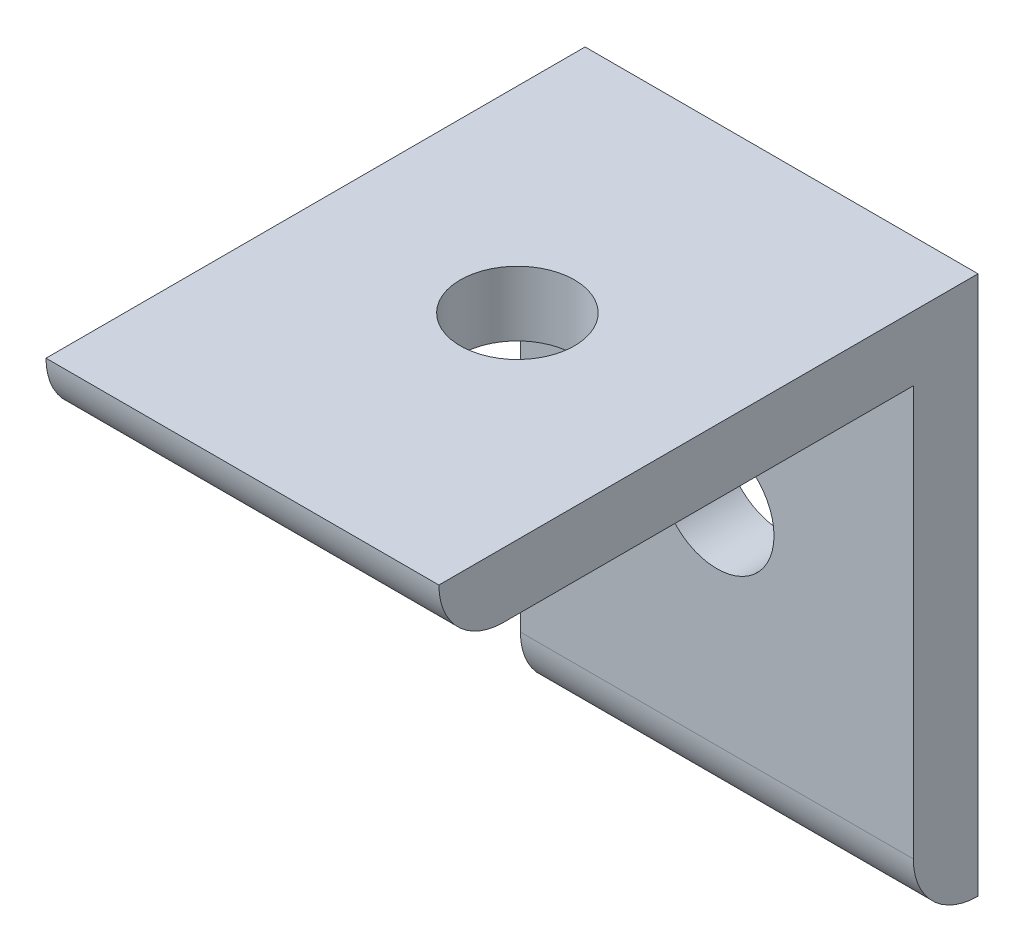
ISO-10303-21;
HEADER;
FILE_DESCRIPTION(('STEP AP214'),'2;1');
FILE_NAME('part.step','',(''),(''),'','','');
FILE_SCHEMA(('AUTOMOTIVE_DESIGN { 1 0 10303 214 1 1 1 1 }'));
ENDSEC;
DATA;
#1=APPLICATION_CONTEXT('core data for automotive mechanical design processes');
#2=APPLICATION_PROTOCOL_DEFINITION('international standard','automotive_design',2000,#1);
#3=PRODUCT_CONTEXT('',#1,'mechanical');
#4=PRODUCT('Part','Part','',(#3));
#5=PRODUCT_RELATED_PRODUCT_CATEGORY('part','',(#4));
#6=PRODUCT_DEFINITION_FORMATION('','',#4);
#7=PRODUCT_DEFINITION_CONTEXT('part definition',#1,'design');
#8=PRODUCT_DEFINITION('design','',#6,#7);
#9=PRODUCT_DEFINITION_SHAPE('','',#8);
#10=(LENGTH_UNIT() NAMED_UNIT(*) SI_UNIT(.MILLI.,.METRE.));
#11=(NAMED_UNIT(*) PLANE_ANGLE_UNIT() SI_UNIT($,.RADIAN.));
#12=(NAMED_UNIT(*) SI_UNIT($,.STERADIAN.) SOLID_ANGLE_UNIT());
#13=UNCERTAINTY_MEASURE_WITH_UNIT(LENGTH_MEASURE(1.E-05),#10,'distance_accuracy_value','');
#14=(GEOMETRIC_REPRESENTATION_CONTEXT(3) GLOBAL_UNCERTAINTY_ASSIGNED_CONTEXT((#13)) GLOBAL_UNIT_ASSIGNED_CONTEXT((#10,
#11,#12)) REPRESENTATION_CONTEXT('',''));
#15=CARTESIAN_POINT('',(0.,0.,0.));
#16=DIRECTION('',(0.,0.,1.));
#17=DIRECTION('',(1.,0.,0.));
#18=AXIS2_PLACEMENT_3D('',#15,#16,#17);
#19=CARTESIAN_POINT('',(-88.5808864008386,-309.665681156461,3.));
#20=DIRECTION('',(1.,0.,0.));
#21=DIRECTION('',(0.,0.,-1.));
#22=AXIS2_PLACEMENT_3D('',#19,#20,#21);
#23=PLANE('',#22);
#24=DIRECTION('',(0.,0.,-1.));
#25=VECTOR('',#24,1.);
#26=CARTESIAN_POINT('',(-88.5808864008386,-312.665681156461,25.));
#27=LINE('',#26,#25);
#28=CARTESIAN_POINT('',(-88.5808864008386,-312.665681156461,22.));
#29=VERTEX_POINT('',#28);
#30=CARTESIAN_POINT('',(-88.5808864008386,-312.665681156461,3.));
#31=VERTEX_POINT('',#30);
#32=EDGE_CURVE('E112',#29,#31,#27,.T.);
#33=ORIENTED_EDGE('',*,*,#32,.F.);
#34=CARTESIAN_POINT('',(-88.5808864008386,-309.665681156461,22.));
#35=DIRECTION('',(1.,0.,0.));
#36=DIRECTION('',(0.,0.,-1.));
#37=AXIS2_PLACEMENT_3D('',#34,#35,#36);
#38=CIRCLE('',#37,3.);
#39=CARTESIAN_POINT('',(-88.5808864008386,-309.665681156461,25.));
#40=VERTEX_POINT('',#39);
#41=EDGE_CURVE('E40',#29,#40,#38,.F.);
#42=ORIENTED_EDGE('',*,*,#41,.T.);
#43=DIRECTION('',(0.,0.,-1.));
#44=VECTOR('',#43,1.);
#45=CARTESIAN_POINT('',(-88.5808864008386,-309.665681156461,3.));
#46=LINE('',#45,#44);
#47=CARTESIAN_POINT('',(-88.5808864008386,-309.665681156461,0.));
#48=VERTEX_POINT('',#47);
#49=EDGE_CURVE('E104',#40,#48,#46,.T.);
#50=ORIENTED_EDGE('',*,*,#49,.T.);
#51=DIRECTION('',(0.,-1.,0.));
#52=VECTOR('',#51,1.);
#53=CARTESIAN_POINT('',(-88.5808864008386,-309.665681156461,0.));
#54=LINE('',#53,#52);
#55=CARTESIAN_POINT('',(-88.5808864008386,-334.665681156461,0.));
#56=VERTEX_POINT('',#55);
#57=EDGE_CURVE('E137',#48,#56,#54,.T.);
#58=ORIENTED_EDGE('',*,*,#57,.T.);
#59=CARTESIAN_POINT('',(-88.5808864008386,-331.665681156461,0.));
#60=DIRECTION('',(1.,0.,0.));
#61=DIRECTION('',(0.,0.,-1.));
#62=AXIS2_PLACEMENT_3D('',#59,#60,#61);
#63=CIRCLE('',#62,3.);
#64=CARTESIAN_POINT('',(-88.5808864008386,-331.665681156461,3.));
#65=VERTEX_POINT('',#64);
#66=EDGE_CURVE('E47',#56,#65,#63,.F.);
#67=ORIENTED_EDGE('',*,*,#66,.T.);
#68=DIRECTION('',(0.,-1.,0.));
#69=VECTOR('',#68,1.);
#70=CARTESIAN_POINT('',(-88.5808864008386,-309.665681156461,3.));
#71=LINE('',#70,#69);
#72=EDGE_CURVE('E127',#31,#65,#71,.T.);
#73=ORIENTED_EDGE('',*,*,#72,.F.);
#74=EDGE_LOOP('',(#33,#42,#50,#58,#67,#73));
#75=FACE_BOUND('',#74,.T.);
#76=ADVANCED_FACE('F32',(#75),#23,.F.);
#77=CARTESIAN_POINT('',(-70.3608864008386,-309.665681156461,3.));
#78=DIRECTION('',(-1.,0.,0.));
#79=DIRECTION('',(0.,0.,1.));
#80=AXIS2_PLACEMENT_3D('',#77,#78,#79);
#81=PLANE('',#80);
#82=DIRECTION('',(0.,0.,-1.));
#83=VECTOR('',#82,1.);
#84=CARTESIAN_POINT('',(-70.3608864008386,-309.665681156461,3.));
#85=LINE('',#84,#83);
#86=CARTESIAN_POINT('',(-70.3608864008386,-309.665681156461,25.));
#87=VERTEX_POINT('',#86);
#88=CARTESIAN_POINT('',(-70.3608864008386,-309.665681156461,0.));
#89=VERTEX_POINT('',#88);
#90=EDGE_CURVE('E98',#87,#89,#85,.T.);
#91=ORIENTED_EDGE('',*,*,#90,.F.);
#92=CARTESIAN_POINT('',(-70.3608864008386,-309.665681156461,22.));
#93=DIRECTION('',(-1.,0.,0.));
#94=DIRECTION('',(0.,0.,1.));
#95=AXIS2_PLACEMENT_3D('',#92,#93,#94);
#96=CIRCLE('',#95,3.);
#97=CARTESIAN_POINT('',(-70.3608864008386,-312.665681156461,22.));
#98=VERTEX_POINT('',#97);
#99=EDGE_CURVE('E87',#87,#98,#96,.F.);
#100=ORIENTED_EDGE('',*,*,#99,.T.);
#101=DIRECTION('',(0.,0.,-1.));
#102=VECTOR('',#101,1.);
#103=CARTESIAN_POINT('',(-70.3608864008386,-312.665681156461,25.));
#104=LINE('',#103,#102);
#105=CARTESIAN_POINT('',(-70.3608864008386,-312.665681156461,3.));
#106=VERTEX_POINT('',#105);
#107=EDGE_CURVE('E109',#98,#106,#104,.T.);
#108=ORIENTED_EDGE('',*,*,#107,.T.);
#109=DIRECTION('',(0.,1.,0.));
#110=VECTOR('',#109,1.);
#111=CARTESIAN_POINT('',(-70.3608864008386,-309.665681156461,3.));
#112=LINE('',#111,#110);
#113=CARTESIAN_POINT('',(-70.3608864008386,-331.665681156461,3.));
#114=VERTEX_POINT('',#113);
#115=EDGE_CURVE('E133',#114,#106,#112,.T.);
#116=ORIENTED_EDGE('',*,*,#115,.F.);
#117=CARTESIAN_POINT('',(-70.3608864008386,-331.665681156461,0.));
#118=DIRECTION('',(-1.,0.,0.));
#119=DIRECTION('',(0.,0.,1.));
#120=AXIS2_PLACEMENT_3D('',#117,#118,#119);
#121=CIRCLE('',#120,3.);
#122=CARTESIAN_POINT('',(-70.3608864008386,-334.665681156461,0.));
#123=VERTEX_POINT('',#122);
#124=EDGE_CURVE('E95',#114,#123,#121,.F.);
#125=ORIENTED_EDGE('',*,*,#124,.T.);
#126=DIRECTION('',(0.,1.,0.));
#127=VECTOR('',#126,1.);
#128=CARTESIAN_POINT('',(-70.3608864008386,-309.665681156461,0.));
#129=LINE('',#128,#127);
#130=EDGE_CURVE('E101',#123,#89,#129,.T.);
#131=ORIENTED_EDGE('',*,*,#130,.T.);
#132=EDGE_LOOP('',(#91,#100,#108,#116,#125,#131));
#133=FACE_BOUND('',#132,.T.);
#134=ADVANCED_FACE('F99',(#133),#81,.F.);
#135=CARTESIAN_POINT('',(-88.5808864008386,-309.665681156461,3.));
#136=DIRECTION('',(0.,-1.,0.));
#137=DIRECTION('',(0.,0.,-1.));
#138=AXIS2_PLACEMENT_3D('',#135,#136,#137);
#139=PLANE('',#138);
#140=CARTESIAN_POINT('',(-79.4708864008386,-309.665681156461,12.25));
#141=DIRECTION('',(0.,-1.,0.));
#142=DIRECTION('',(0.,0.,-1.));
#143=AXIS2_PLACEMENT_3D('',#140,#141,#142);
#144=CIRCLE('',#143,2.65);
#145=CARTESIAN_POINT('',(-79.4708864008386,-309.665681156461,9.6));
#146=VERTEX_POINT('',#145);
#147=EDGE_CURVE('E199',#146,#146,#144,.T.);
#148=ORIENTED_EDGE('',*,*,#147,.T.);
#149=EDGE_LOOP('',(#148));
#150=FACE_BOUND('',#149,.T.);
#151=DIRECTION('',(-1.,0.,0.));
#152=VECTOR('',#151,1.);
#153=CARTESIAN_POINT('',(-88.5808864008386,-309.665681156461,0.));
#154=LINE('',#153,#152);
#155=EDGE_CURVE('E143',#89,#48,#154,.T.);
#156=ORIENTED_EDGE('',*,*,#155,.T.);
#157=ORIENTED_EDGE('',*,*,#49,.F.);
#158=DIRECTION('',(-1.,0.,0.));
#159=VECTOR('',#158,1.);
#160=CARTESIAN_POINT('',(-88.5808864008386,-309.665681156461,25.));
#161=LINE('',#160,#159);
#162=EDGE_CURVE('E92',#87,#40,#161,.T.);
#163=ORIENTED_EDGE('',*,*,#162,.F.);
#164=ORIENTED_EDGE('',*,*,#90,.T.);
#165=EDGE_LOOP('',(#156,#157,#163,#164));
#166=FACE_BOUND('',#165,.T.);
#167=ADVANCED_FACE('F107',(#150,#166),#139,.F.);
#168=CARTESIAN_POINT('',(0.,0.,3.));
#169=DIRECTION('',(0.,0.,1.));
#170=DIRECTION('',(1.,0.,0.));
#171=AXIS2_PLACEMENT_3D('',#168,#169,#170);
#172=PLANE('',#171);
#173=CARTESIAN_POINT('',(-79.4708864008386,-321.91568115646,3.));
#174=DIRECTION('',(0.,0.,1.));
#175=DIRECTION('',(1.,0.,0.));
#176=AXIS2_PLACEMENT_3D('',#173,#174,#175);
#177=CIRCLE('',#176,2.65);
#178=CARTESIAN_POINT('',(-76.8208864008386,-321.91568115646,3.));
#179=VERTEX_POINT('',#178);
#180=EDGE_CURVE('E119',#179,#179,#177,.T.);
#181=ORIENTED_EDGE('',*,*,#180,.F.);
#182=EDGE_LOOP('',(#181));
#183=FACE_BOUND('',#182,.T.);
#184=ORIENTED_EDGE('',*,*,#72,.T.);
#185=DIRECTION('',(1.,0.,0.));
#186=VECTOR('',#185,1.);
#187=CARTESIAN_POINT('',(-70.3608864008386,-331.665681156461,3.));
#188=LINE('',#187,#186);
#189=EDGE_CURVE('E11',#65,#114,#188,.T.);
#190=ORIENTED_EDGE('',*,*,#189,.T.);
#191=ORIENTED_EDGE('',*,*,#115,.T.);
#192=DIRECTION('',(1.,0.,0.));
#193=VECTOR('',#192,1.);
#194=CARTESIAN_POINT('',(-88.5808864008386,-312.665681156461,3.));
#195=LINE('',#194,#193);
#196=EDGE_CURVE('E110',#31,#106,#195,.T.);
#197=ORIENTED_EDGE('',*,*,#196,.F.);
#198=EDGE_LOOP('',(#184,#190,#191,#197));
#199=FACE_BOUND('',#198,.T.);
#200=ADVANCED_FACE('F156',(#183,#199),#172,.T.);
#201=CARTESIAN_POINT('',(0.,0.,0.));
#202=DIRECTION('',(0.,0.,1.));
#203=DIRECTION('',(1.,0.,0.));
#204=AXIS2_PLACEMENT_3D('',#201,#202,#203);
#205=PLANE('',#204);
#206=CARTESIAN_POINT('',(-79.4708864008386,-321.91568115646,0.));
#207=DIRECTION('',(0.,0.,1.));
#208=DIRECTION('',(1.,0.,0.));
#209=AXIS2_PLACEMENT_3D('',#206,#207,#208);
#210=CIRCLE('',#209,2.65);
#211=CARTESIAN_POINT('',(-76.8208864008386,-321.91568115646,0.));
#212=VERTEX_POINT('',#211);
#213=EDGE_CURVE('E115',#212,#212,#210,.T.);
#214=ORIENTED_EDGE('',*,*,#213,.T.);
#215=EDGE_LOOP('',(#214));
#216=FACE_BOUND('',#215,.T.);
#217=ORIENTED_EDGE('',*,*,#57,.F.);
#218=ORIENTED_EDGE('',*,*,#155,.F.);
#219=ORIENTED_EDGE('',*,*,#130,.F.);
#220=DIRECTION('',(1.,0.,0.));
#221=VECTOR('',#220,1.);
#222=CARTESIAN_POINT('',(-88.5808864008386,-334.665681156461,0.));
#223=LINE('',#222,#221);
#224=EDGE_CURVE('E139',#56,#123,#223,.T.);
#225=ORIENTED_EDGE('',*,*,#224,.F.);
#226=EDGE_LOOP('',(#217,#218,#219,#225));
#227=FACE_BOUND('',#226,.T.);
#228=ADVANCED_FACE('F147',(#216,#227),#205,.F.);
#229=CARTESIAN_POINT('',(-88.5808864008386,-312.665681156461,25.));
#230=DIRECTION('',(0.,1.,0.));
#231=DIRECTION('',(0.,0.,1.));
#232=AXIS2_PLACEMENT_3D('',#229,#230,#231);
#233=PLANE('',#232);
#234=CARTESIAN_POINT('',(-79.4708864008386,-312.665681156461,12.25));
#235=DIRECTION('',(0.,-1.,0.));
#236=DIRECTION('',(0.,0.,-1.));
#237=AXIS2_PLACEMENT_3D('',#234,#235,#236);
#238=CIRCLE('',#237,2.65);
#239=CARTESIAN_POINT('',(-79.4708864008386,-312.665681156461,9.6));
#240=VERTEX_POINT('',#239);
#241=EDGE_CURVE('E198',#240,#240,#238,.T.);
#242=ORIENTED_EDGE('',*,*,#241,.F.);
#243=EDGE_LOOP('',(#242));
#244=FACE_BOUND('',#243,.T.);
#245=ORIENTED_EDGE('',*,*,#107,.F.);
#246=DIRECTION('',(1.,0.,0.));
#247=VECTOR('',#246,1.);
#248=CARTESIAN_POINT('',(-88.5808864008386,-312.665681156461,22.));
#249=LINE('',#248,#247);
#250=EDGE_CURVE('E55',#98,#29,#249,.F.);
#251=ORIENTED_EDGE('',*,*,#250,.T.);
#252=ORIENTED_EDGE('',*,*,#32,.T.);
#253=ORIENTED_EDGE('',*,*,#196,.T.);
#254=EDGE_LOOP('',(#245,#251,#252,#253));
#255=FACE_BOUND('',#254,.T.);
#256=ADVANCED_FACE('F154',(#244,#255),#233,.F.);
#257=CARTESIAN_POINT('',(-79.4708864008386,-321.91568115646,-22.));
#258=DIRECTION('',(0.,0.,1.));
#259=DIRECTION('',(1.,0.,0.));
#260=AXIS2_PLACEMENT_3D('',#257,#258,#259);
#261=CYLINDRICAL_SURFACE('',#260,2.65);
#262=ORIENTED_EDGE('',*,*,#180,.T.);
#263=EDGE_LOOP('',(#262));
#264=FACE_BOUND('',#263,.T.);
#265=ORIENTED_EDGE('',*,*,#213,.F.);
#266=EDGE_LOOP('',(#265));
#267=FACE_BOUND('',#266,.T.);
#268=ADVANCED_FACE('F183',(#264,#267),#261,.F.);
#269=CARTESIAN_POINT('',(-79.4708864008386,-287.66568115646,12.25));
#270=DIRECTION('',(0.,-1.,0.));
#271=DIRECTION('',(0.,0.,-1.));
#272=AXIS2_PLACEMENT_3D('',#269,#270,#271);
#273=CYLINDRICAL_SURFACE('',#272,2.65);
#274=ORIENTED_EDGE('',*,*,#241,.T.);
#275=EDGE_LOOP('',(#274));
#276=FACE_BOUND('',#275,.T.);
#277=ORIENTED_EDGE('',*,*,#147,.F.);
#278=EDGE_LOOP('',(#277));
#279=FACE_BOUND('',#278,.T.);
#280=ADVANCED_FACE('F178',(#276,#279),#273,.F.);
#281=CARTESIAN_POINT('',(0.,-309.665681156461,22.));
#282=DIRECTION('',(-1.,0.,0.));
#283=DIRECTION('',(0.,0.,1.));
#284=AXIS2_PLACEMENT_3D('',#281,#282,#283);
#285=CYLINDRICAL_SURFACE('',#284,3.);
#286=ORIENTED_EDGE('',*,*,#41,.F.);
#287=ORIENTED_EDGE('',*,*,#250,.F.);
#288=ORIENTED_EDGE('',*,*,#99,.F.);
#289=ORIENTED_EDGE('',*,*,#162,.T.);
#290=EDGE_LOOP('',(#286,#287,#288,#289));
#291=FACE_BOUND('',#290,.T.);
#292=ADVANCED_FACE('F90',(#291),#285,.T.);
#293=CARTESIAN_POINT('',(0.,-331.665681156461,0.));
#294=DIRECTION('',(-1.,0.,0.));
#295=DIRECTION('',(0.,0.,1.));
#296=AXIS2_PLACEMENT_3D('',#293,#294,#295);
#297=CYLINDRICAL_SURFACE('',#296,3.);
#298=ORIENTED_EDGE('',*,*,#66,.F.);
#299=ORIENTED_EDGE('',*,*,#224,.T.);
#300=ORIENTED_EDGE('',*,*,#124,.F.);
#301=ORIENTED_EDGE('',*,*,#189,.F.);
#302=EDGE_LOOP('',(#298,#299,#300,#301));
#303=FACE_BOUND('',#302,.T.);
#304=ADVANCED_FACE('F34',(#303),#297,.T.);
#305=CLOSED_SHELL('',(#76,#134,#167,#200,#228,#256,#268,#280,#292,#304));
#306=MANIFOLD_SOLID_BREP('B2',#305);
#307=ADVANCED_BREP_SHAPE_REPRESENTATION('',(#18,#306),#14);
#308=SHAPE_DEFINITION_REPRESENTATION(#9,#307);
ENDSEC;
END-ISO-10303-21;
